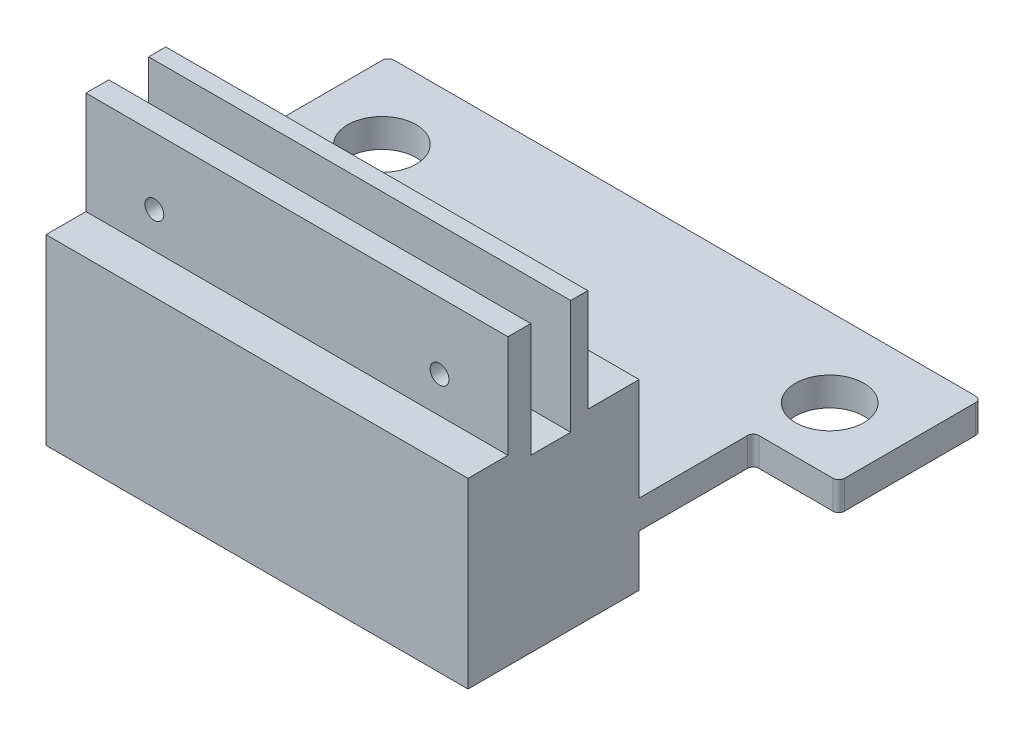
ISO-10303-21;
HEADER;
FILE_DESCRIPTION(('STEP AP214'),'2;1');
FILE_NAME('part.step','',(''),(''),'','','');
FILE_SCHEMA(('AUTOMOTIVE_DESIGN { 1 0 10303 214 1 1 1 1 }'));
ENDSEC;
DATA;
#1=APPLICATION_CONTEXT('core data for automotive mechanical design processes');
#2=APPLICATION_PROTOCOL_DEFINITION('international standard','automotive_design',2000,#1);
#3=PRODUCT_CONTEXT('',#1,'mechanical');
#4=PRODUCT('Part','Part','',(#3));
#5=PRODUCT_RELATED_PRODUCT_CATEGORY('part','',(#4));
#6=PRODUCT_DEFINITION_FORMATION('','',#4);
#7=PRODUCT_DEFINITION_CONTEXT('part definition',#1,'design');
#8=PRODUCT_DEFINITION('design','',#6,#7);
#9=PRODUCT_DEFINITION_SHAPE('','',#8);
#10=(LENGTH_UNIT() NAMED_UNIT(*) SI_UNIT(.MILLI.,.METRE.));
#11=(NAMED_UNIT(*) PLANE_ANGLE_UNIT() SI_UNIT($,.RADIAN.));
#12=(NAMED_UNIT(*) SI_UNIT($,.STERADIAN.) SOLID_ANGLE_UNIT());
#13=UNCERTAINTY_MEASURE_WITH_UNIT(LENGTH_MEASURE(1.E-05),#10,'distance_accuracy_value','');
#14=(GEOMETRIC_REPRESENTATION_CONTEXT(3) GLOBAL_UNCERTAINTY_ASSIGNED_CONTEXT((#13)) GLOBAL_UNIT_ASSIGNED_CONTEXT((#10,
#11,#12)) REPRESENTATION_CONTEXT('',''));
#15=CARTESIAN_POINT('',(0.,0.,0.));
#16=DIRECTION('',(0.,0.,1.));
#17=DIRECTION('',(1.,0.,0.));
#18=AXIS2_PLACEMENT_3D('',#15,#16,#17);
#19=CARTESIAN_POINT('',(0.,0.,30.));
#20=DIRECTION('',(1.,0.,0.));
#21=DIRECTION('',(0.,0.,-1.));
#22=AXIS2_PLACEMENT_3D('',#19,#20,#21);
#23=PLANE('',#22);
#24=DIRECTION('',(0.,0.,1.));
#25=VECTOR('',#24,1.);
#26=CARTESIAN_POINT('',(0.,14.,-45.));
#27=LINE('',#26,#25);
#28=CARTESIAN_POINT('',(0.,14.,-19.));
#29=VERTEX_POINT('',#28);
#30=CARTESIAN_POINT('',(0.,14.,0.));
#31=VERTEX_POINT('',#30);
#32=EDGE_CURVE('E220',#29,#31,#27,.T.);
#33=ORIENTED_EDGE('',*,*,#32,.F.);
#34=DIRECTION('',(0.,1.,0.));
#35=VECTOR('',#34,1.);
#36=CARTESIAN_POINT('',(0.,9.,-19.));
#37=LINE('',#36,#35);
#38=CARTESIAN_POINT('',(0.,9.,-19.));
#39=VERTEX_POINT('',#38);
#40=EDGE_CURVE('E214',#29,#39,#37,.F.);
#41=ORIENTED_EDGE('',*,*,#40,.T.);
#42=DIRECTION('',(0.,0.,1.));
#43=VECTOR('',#42,1.);
#44=CARTESIAN_POINT('',(0.,9.,-45.));
#45=LINE('',#44,#43);
#46=CARTESIAN_POINT('',(0.,9.,0.));
#47=VERTEX_POINT('',#46);
#48=EDGE_CURVE('E209',#39,#47,#45,.T.);
#49=ORIENTED_EDGE('',*,*,#48,.T.);
#50=DIRECTION('',(0.,-1.,0.));
#51=VECTOR('',#50,1.);
#52=CARTESIAN_POINT('',(0.,0.,0.));
#53=LINE('',#52,#51);
#54=CARTESIAN_POINT('',(0.,0.,0.));
#55=VERTEX_POINT('',#54);
#56=EDGE_CURVE('E212',#47,#55,#53,.T.);
#57=ORIENTED_EDGE('',*,*,#56,.T.);
#58=DIRECTION('',(0.,0.,-1.));
#59=VECTOR('',#58,1.);
#60=CARTESIAN_POINT('',(0.,0.,30.));
#61=LINE('',#60,#59);
#62=CARTESIAN_POINT('',(0.,0.,30.));
#63=VERTEX_POINT('',#62);
#64=EDGE_CURVE('E417',#63,#55,#61,.T.);
#65=ORIENTED_EDGE('',*,*,#64,.F.);
#66=DIRECTION('',(0.,-1.,0.));
#67=VECTOR('',#66,1.);
#68=CARTESIAN_POINT('',(0.,0.,30.));
#69=LINE('',#68,#67);
#70=CARTESIAN_POINT('',(0.,32.,30.));
#71=VERTEX_POINT('',#70);
#72=EDGE_CURVE('E387',#71,#63,#69,.T.);
#73=ORIENTED_EDGE('',*,*,#72,.F.);
#74=DIRECTION('',(0.,0.,-1.));
#75=VECTOR('',#74,1.);
#76=CARTESIAN_POINT('',(0.,32.,30.));
#77=LINE('',#76,#75);
#78=CARTESIAN_POINT('',(0.,32.,23.));
#79=VERTEX_POINT('',#78);
#80=EDGE_CURVE('E318',#71,#79,#77,.T.);
#81=ORIENTED_EDGE('',*,*,#80,.T.);
#82=DIRECTION('',(0.,1.,0.));
#83=VECTOR('',#82,1.);
#84=CARTESIAN_POINT('',(0.,0.,23.));
#85=LINE('',#84,#83);
#86=CARTESIAN_POINT('',(0.,50.,23.));
#87=VERTEX_POINT('',#86);
#88=EDGE_CURVE('E322',#79,#87,#85,.T.);
#89=ORIENTED_EDGE('',*,*,#88,.T.);
#90=DIRECTION('',(0.,0.,-1.));
#91=VECTOR('',#90,1.);
#92=CARTESIAN_POINT('',(0.,50.,30.));
#93=LINE('',#92,#91);
#94=CARTESIAN_POINT('',(0.,50.,19.));
#95=VERTEX_POINT('',#94);
#96=EDGE_CURVE('E406',#87,#95,#93,.T.);
#97=ORIENTED_EDGE('',*,*,#96,.T.);
#98=DIRECTION('',(0.,1.,0.));
#99=VECTOR('',#98,1.);
#100=CARTESIAN_POINT('',(0.,50.,19.));
#101=LINE('',#100,#99);
#102=CARTESIAN_POINT('',(0.,30.,19.));
#103=VERTEX_POINT('',#102);
#104=EDGE_CURVE('E338',#103,#95,#101,.T.);
#105=ORIENTED_EDGE('',*,*,#104,.F.);
#106=DIRECTION('',(0.,0.,1.));
#107=VECTOR('',#106,1.);
#108=CARTESIAN_POINT('',(0.,30.,12.));
#109=LINE('',#108,#107);
#110=CARTESIAN_POINT('',(0.,30.,12.));
#111=VERTEX_POINT('',#110);
#112=EDGE_CURVE('E334',#111,#103,#109,.T.);
#113=ORIENTED_EDGE('',*,*,#112,.F.);
#114=DIRECTION('',(0.,-1.,0.));
#115=VECTOR('',#114,1.);
#116=CARTESIAN_POINT('',(0.,50.,12.));
#117=LINE('',#116,#115);
#118=CARTESIAN_POINT('',(0.,50.,12.));
#119=VERTEX_POINT('',#118);
#120=EDGE_CURVE('E330',#119,#111,#117,.T.);
#121=ORIENTED_EDGE('',*,*,#120,.F.);
#122=CARTESIAN_POINT('',(0.,50.,9.));
#123=VERTEX_POINT('',#122);
#124=EDGE_CURVE('E397',#119,#123,#93,.T.);
#125=ORIENTED_EDGE('',*,*,#124,.T.);
#126=DIRECTION('',(0.,-1.,0.));
#127=VECTOR('',#126,1.);
#128=CARTESIAN_POINT('',(0.,0.,9.));
#129=LINE('',#128,#127);
#130=CARTESIAN_POINT('',(0.,32.,9.));
#131=VERTEX_POINT('',#130);
#132=EDGE_CURVE('E326',#123,#131,#129,.T.);
#133=ORIENTED_EDGE('',*,*,#132,.T.);
#134=DIRECTION('',(0.,0.,-1.));
#135=VECTOR('',#134,1.);
#136=CARTESIAN_POINT('',(0.,32.,30.));
#137=LINE('',#136,#135);
#138=CARTESIAN_POINT('',(0.,32.,0.));
#139=VERTEX_POINT('',#138);
#140=EDGE_CURVE('E300',#131,#139,#137,.T.);
#141=ORIENTED_EDGE('',*,*,#140,.T.);
#142=EDGE_CURVE('E231',#139,#31,#53,.T.);
#143=ORIENTED_EDGE('',*,*,#142,.T.);
#144=EDGE_LOOP('',(#33,#41,#49,#57,#65,#73,#81,#89,#97,#105,#113,#121,#125,#133,#141,#143));
#145=FACE_BOUND('',#144,.T.);
#146=ADVANCED_FACE('F38',(#145),#23,.F.);
#147=CARTESIAN_POINT('',(74.,0.,30.));
#148=DIRECTION('',(-1.,0.,0.));
#149=DIRECTION('',(0.,0.,1.));
#150=AXIS2_PLACEMENT_3D('',#147,#148,#149);
#151=PLANE('',#150);
#152=DIRECTION('',(0.,0.,1.));
#153=VECTOR('',#152,1.);
#154=CARTESIAN_POINT('',(74.,9.,-45.));
#155=LINE('',#154,#153);
#156=CARTESIAN_POINT('',(74.,9.,-19.));
#157=VERTEX_POINT('',#156);
#158=CARTESIAN_POINT('',(74.,9.,0.));
#159=VERTEX_POINT('',#158);
#160=EDGE_CURVE('E219',#157,#159,#155,.T.);
#161=ORIENTED_EDGE('',*,*,#160,.F.);
#162=DIRECTION('',(0.,-1.,0.));
#163=VECTOR('',#162,1.);
#164=CARTESIAN_POINT('',(74.,14.,-19.));
#165=LINE('',#164,#163);
#166=CARTESIAN_POINT('',(74.,14.,-19.));
#167=VERTEX_POINT('',#166);
#168=EDGE_CURVE('E462',#157,#167,#165,.F.);
#169=ORIENTED_EDGE('',*,*,#168,.T.);
#170=DIRECTION('',(0.,0.,1.));
#171=VECTOR('',#170,1.);
#172=CARTESIAN_POINT('',(74.,14.,-45.));
#173=LINE('',#172,#171);
#174=CARTESIAN_POINT('',(74.,14.,0.));
#175=VERTEX_POINT('',#174);
#176=EDGE_CURVE('E253',#167,#175,#173,.T.);
#177=ORIENTED_EDGE('',*,*,#176,.T.);
#178=DIRECTION('',(0.,1.,0.));
#179=VECTOR('',#178,1.);
#180=CARTESIAN_POINT('',(74.,0.,0.));
#181=LINE('',#180,#179);
#182=CARTESIAN_POINT('',(74.,32.,0.));
#183=VERTEX_POINT('',#182);
#184=EDGE_CURVE('E403',#175,#183,#181,.T.);
#185=ORIENTED_EDGE('',*,*,#184,.T.);
#186=DIRECTION('',(0.,0.,-1.));
#187=VECTOR('',#186,1.);
#188=CARTESIAN_POINT('',(74.,32.,0.));
#189=LINE('',#188,#187);
#190=CARTESIAN_POINT('',(74.,32.,9.));
#191=VERTEX_POINT('',#190);
#192=EDGE_CURVE('E306',#191,#183,#189,.T.);
#193=ORIENTED_EDGE('',*,*,#192,.F.);
#194=DIRECTION('',(0.,-1.,0.));
#195=VECTOR('',#194,1.);
#196=CARTESIAN_POINT('',(74.,50.,9.));
#197=LINE('',#196,#195);
#198=CARTESIAN_POINT('',(74.,50.,9.));
#199=VERTEX_POINT('',#198);
#200=EDGE_CURVE('E286',#199,#191,#197,.T.);
#201=ORIENTED_EDGE('',*,*,#200,.F.);
#202=DIRECTION('',(0.,0.,-1.));
#203=VECTOR('',#202,1.);
#204=CARTESIAN_POINT('',(74.,50.,30.));
#205=LINE('',#204,#203);
#206=CARTESIAN_POINT('',(74.,50.,12.));
#207=VERTEX_POINT('',#206);
#208=EDGE_CURVE('E409',#207,#199,#205,.T.);
#209=ORIENTED_EDGE('',*,*,#208,.F.);
#210=DIRECTION('',(0.,-1.,0.));
#211=VECTOR('',#210,1.);
#212=CARTESIAN_POINT('',(74.,0.,12.));
#213=LINE('',#212,#211);
#214=CARTESIAN_POINT('',(74.,30.,12.));
#215=VERTEX_POINT('',#214);
#216=EDGE_CURVE('E352',#207,#215,#213,.T.);
#217=ORIENTED_EDGE('',*,*,#216,.T.);
#218=DIRECTION('',(0.,0.,1.));
#219=VECTOR('',#218,1.);
#220=CARTESIAN_POINT('',(74.,30.,30.));
#221=LINE('',#220,#219);
#222=CARTESIAN_POINT('',(74.,30.,19.));
#223=VERTEX_POINT('',#222);
#224=EDGE_CURVE('E428',#215,#223,#221,.T.);
#225=ORIENTED_EDGE('',*,*,#224,.T.);
#226=DIRECTION('',(0.,1.,0.));
#227=VECTOR('',#226,1.);
#228=CARTESIAN_POINT('',(74.,0.,19.));
#229=LINE('',#228,#227);
#230=CARTESIAN_POINT('',(74.,50.,19.));
#231=VERTEX_POINT('',#230);
#232=EDGE_CURVE('E346',#223,#231,#229,.T.);
#233=ORIENTED_EDGE('',*,*,#232,.T.);
#234=CARTESIAN_POINT('',(74.,50.,23.));
#235=VERTEX_POINT('',#234);
#236=EDGE_CURVE('E410',#235,#231,#205,.T.);
#237=ORIENTED_EDGE('',*,*,#236,.F.);
#238=DIRECTION('',(0.,1.,0.));
#239=VECTOR('',#238,1.);
#240=CARTESIAN_POINT('',(74.,50.,23.));
#241=LINE('',#240,#239);
#242=CARTESIAN_POINT('',(74.,32.,23.));
#243=VERTEX_POINT('',#242);
#244=EDGE_CURVE('E291',#243,#235,#241,.T.);
#245=ORIENTED_EDGE('',*,*,#244,.F.);
#246=DIRECTION('',(0.,0.,-1.));
#247=VECTOR('',#246,1.);
#248=CARTESIAN_POINT('',(74.,32.,30.));
#249=LINE('',#248,#247);
#250=CARTESIAN_POINT('',(74.,32.,30.));
#251=VERTEX_POINT('',#250);
#252=EDGE_CURVE('E287',#251,#243,#249,.T.);
#253=ORIENTED_EDGE('',*,*,#252,.F.);
#254=DIRECTION('',(0.,1.,0.));
#255=VECTOR('',#254,1.);
#256=CARTESIAN_POINT('',(74.,0.,30.));
#257=LINE('',#256,#255);
#258=CARTESIAN_POINT('',(74.,0.,30.));
#259=VERTEX_POINT('',#258);
#260=EDGE_CURVE('E394',#259,#251,#257,.T.);
#261=ORIENTED_EDGE('',*,*,#260,.F.);
#262=DIRECTION('',(0.,0.,-1.));
#263=VECTOR('',#262,1.);
#264=CARTESIAN_POINT('',(74.,0.,30.));
#265=LINE('',#264,#263);
#266=CARTESIAN_POINT('',(74.,0.,0.));
#267=VERTEX_POINT('',#266);
#268=EDGE_CURVE('E413',#259,#267,#265,.T.);
#269=ORIENTED_EDGE('',*,*,#268,.T.);
#270=EDGE_CURVE('E391',#267,#159,#181,.T.);
#271=ORIENTED_EDGE('',*,*,#270,.T.);
#272=EDGE_LOOP('',(#161,#169,#177,#185,#193,#201,#209,#217,#225,#233,#237,#245,#253,#261,#269,#271));
#273=FACE_BOUND('',#272,.T.);
#274=ADVANCED_FACE('F590',(#273),#151,.F.);
#275=CARTESIAN_POINT('',(0.,0.,0.));
#276=DIRECTION('',(0.,0.,-1.));
#277=DIRECTION('',(-1.,0.,0.));
#278=AXIS2_PLACEMENT_3D('',#275,#276,#277);
#279=PLANE('',#278);
#280=DIRECTION('',(1.,0.,0.));
#281=VECTOR('',#280,1.);
#282=CARTESIAN_POINT('',(74.,14.,0.));
#283=LINE('',#282,#281);
#284=EDGE_CURVE('E238',#31,#175,#283,.T.);
#285=ORIENTED_EDGE('',*,*,#284,.F.);
#286=ORIENTED_EDGE('',*,*,#142,.F.);
#287=DIRECTION('',(-1.,0.,0.));
#288=VECTOR('',#287,1.);
#289=CARTESIAN_POINT('',(0.,32.,0.));
#290=LINE('',#289,#288);
#291=EDGE_CURVE('E432',#183,#139,#290,.T.);
#292=ORIENTED_EDGE('',*,*,#291,.F.);
#293=ORIENTED_EDGE('',*,*,#184,.F.);
#294=EDGE_LOOP('',(#285,#286,#292,#293));
#295=FACE_BOUND('',#294,.T.);
#296=ADVANCED_FACE('F595',(#295),#279,.T.);
#297=CARTESIAN_POINT('',(0.,50.,30.));
#298=DIRECTION('',(0.,-1.,0.));
#299=DIRECTION('',(0.,0.,-1.));
#300=AXIS2_PLACEMENT_3D('',#297,#298,#299);
#301=PLANE('',#300);
#302=ORIENTED_EDGE('',*,*,#208,.T.);
#303=DIRECTION('',(1.,0.,0.));
#304=VECTOR('',#303,1.);
#305=CARTESIAN_POINT('',(-37.0000000000001,50.,9.));
#306=LINE('',#305,#304);
#307=EDGE_CURVE('E310',#123,#199,#306,.T.);
#308=ORIENTED_EDGE('',*,*,#307,.F.);
#309=ORIENTED_EDGE('',*,*,#124,.F.);
#310=DIRECTION('',(1.,0.,0.));
#311=VECTOR('',#310,1.);
#312=CARTESIAN_POINT('',(0.,50.,12.));
#313=LINE('',#312,#311);
#314=EDGE_CURVE('E424',#119,#207,#313,.T.);
#315=ORIENTED_EDGE('',*,*,#314,.T.);
#316=EDGE_LOOP('',(#302,#308,#309,#315));
#317=FACE_BOUND('',#316,.T.);
#318=ADVANCED_FACE('F682',(#317),#301,.F.);
#319=CARTESIAN_POINT('',(0.,0.,30.));
#320=DIRECTION('',(0.,1.,0.));
#321=DIRECTION('',(0.,0.,1.));
#322=AXIS2_PLACEMENT_3D('',#319,#320,#321);
#323=PLANE('',#322);
#324=CARTESIAN_POINT('',(12.74,0.,15.));
#325=DIRECTION('',(0.,-1.,0.));
#326=DIRECTION('',(0.,0.,-1.));
#327=AXIS2_PLACEMENT_3D('',#324,#325,#326);
#328=CIRCLE('',#327,10.5);
#329=CARTESIAN_POINT('',(12.74,0.,4.5));
#330=VERTEX_POINT('',#329);
#331=EDGE_CURVE('E376',#330,#330,#328,.T.);
#332=ORIENTED_EDGE('',*,*,#331,.F.);
#333=EDGE_LOOP('',(#332));
#334=FACE_BOUND('',#333,.T.);
#335=CARTESIAN_POINT('',(61.26167258,0.,15.0000000000002));
#336=DIRECTION('',(0.,-1.,0.));
#337=DIRECTION('',(0.,0.,-1.));
#338=AXIS2_PLACEMENT_3D('',#335,#336,#337);
#339=CIRCLE('',#338,10.5);
#340=CARTESIAN_POINT('',(61.26167258,0.,4.50000000000016));
#341=VERTEX_POINT('',#340);
#342=EDGE_CURVE('E361',#341,#341,#339,.T.);
#343=ORIENTED_EDGE('',*,*,#342,.F.);
#344=EDGE_LOOP('',(#343));
#345=FACE_BOUND('',#344,.T.);
#346=DIRECTION('',(1.,0.,0.));
#347=VECTOR('',#346,1.);
#348=CARTESIAN_POINT('',(0.,0.,0.));
#349=LINE('',#348,#347);
#350=EDGE_CURVE('E228',#55,#267,#349,.T.);
#351=ORIENTED_EDGE('',*,*,#350,.T.);
#352=ORIENTED_EDGE('',*,*,#268,.F.);
#353=DIRECTION('',(1.,0.,0.));
#354=VECTOR('',#353,1.);
#355=CARTESIAN_POINT('',(0.,0.,30.));
#356=LINE('',#355,#354);
#357=EDGE_CURVE('E390',#63,#259,#356,.T.);
#358=ORIENTED_EDGE('',*,*,#357,.F.);
#359=ORIENTED_EDGE('',*,*,#64,.T.);
#360=EDGE_LOOP('',(#351,#352,#358,#359));
#361=FACE_BOUND('',#360,.T.);
#362=ADVANCED_FACE('F600',(#334,#345,#361),#323,.F.);
#363=ORIENTED_EDGE('',*,*,#96,.F.);
#364=DIRECTION('',(1.,0.,0.));
#365=VECTOR('',#364,1.);
#366=CARTESIAN_POINT('',(-37.0000000000001,50.,23.));
#367=LINE('',#366,#365);
#368=EDGE_CURVE('E296',#87,#235,#367,.T.);
#369=ORIENTED_EDGE('',*,*,#368,.T.);
#370=ORIENTED_EDGE('',*,*,#236,.T.);
#371=DIRECTION('',(-1.,0.,0.));
#372=VECTOR('',#371,1.);
#373=CARTESIAN_POINT('',(0.,50.,19.));
#374=LINE('',#373,#372);
#375=EDGE_CURVE('E420',#231,#95,#374,.T.);
#376=ORIENTED_EDGE('',*,*,#375,.T.);
#377=EDGE_LOOP('',(#363,#369,#370,#376));
#378=FACE_BOUND('',#377,.T.);
#379=ADVANCED_FACE('F667',(#378),#301,.F.);
#380=CARTESIAN_POINT('',(0.,0.,30.));
#381=DIRECTION('',(0.,0.,-1.));
#382=DIRECTION('',(-1.,0.,0.));
#383=AXIS2_PLACEMENT_3D('',#380,#381,#382);
#384=PLANE('',#383);
#385=ORIENTED_EDGE('',*,*,#260,.T.);
#386=DIRECTION('',(-1.,0.,0.));
#387=VECTOR('',#386,1.);
#388=CARTESIAN_POINT('',(0.,32.,30.));
#389=LINE('',#388,#387);
#390=EDGE_CURVE('E435',#251,#71,#389,.T.);
#391=ORIENTED_EDGE('',*,*,#390,.T.);
#392=ORIENTED_EDGE('',*,*,#72,.T.);
#393=ORIENTED_EDGE('',*,*,#357,.T.);
#394=EDGE_LOOP('',(#385,#391,#392,#393));
#395=FACE_BOUND('',#394,.T.);
#396=ADVANCED_FACE('F657',(#395),#384,.F.);
#397=DIRECTION('',(-1.,0.,0.));
#398=VECTOR('',#397,1.);
#399=CARTESIAN_POINT('',(74.,9.,0.));
#400=LINE('',#399,#398);
#401=EDGE_CURVE('E226',#159,#47,#400,.T.);
#402=ORIENTED_EDGE('',*,*,#401,.F.);
#403=ORIENTED_EDGE('',*,*,#270,.F.);
#404=ORIENTED_EDGE('',*,*,#350,.F.);
#405=ORIENTED_EDGE('',*,*,#56,.F.);
#406=EDGE_LOOP('',(#402,#403,#404,#405));
#407=FACE_BOUND('',#406,.T.);
#408=ADVANCED_FACE('F224',(#407),#279,.T.);
#409=CARTESIAN_POINT('',(61.26167258,10.,15.0000000000002));
#410=DIRECTION('',(0.,-1.,0.));
#411=DIRECTION('',(0.,0.,-1.));
#412=AXIS2_PLACEMENT_3D('',#409,#410,#411);
#413=CYLINDRICAL_SURFACE('',#412,10.5);
#414=CARTESIAN_POINT('',(61.26167258,10.,15.0000000000002));
#415=DIRECTION('',(0.,-1.,0.));
#416=DIRECTION('',(0.,0.,-1.));
#417=AXIS2_PLACEMENT_3D('',#414,#415,#416);
#418=CIRCLE('',#417,10.5);
#419=CARTESIAN_POINT('',(61.26167258,10.,4.50000000000016));
#420=VERTEX_POINT('',#419);
#421=EDGE_CURVE('E380',#420,#420,#418,.T.);
#422=ORIENTED_EDGE('',*,*,#421,.F.);
#423=EDGE_LOOP('',(#422));
#424=FACE_BOUND('',#423,.T.);
#425=ORIENTED_EDGE('',*,*,#342,.T.);
#426=EDGE_LOOP('',(#425));
#427=FACE_BOUND('',#426,.T.);
#428=ADVANCED_FACE('F704',(#424,#427),#413,.F.);
#429=CARTESIAN_POINT('',(61.26167258,10.,15.0000000000002));
#430=DIRECTION('',(0.,-1.,0.));
#431=DIRECTION('',(0.,0.,-1.));
#432=AXIS2_PLACEMENT_3D('',#429,#430,#431);
#433=PLANE('',#432);
#434=CARTESIAN_POINT('',(61.26167258,10.,15.0000000000002));
#435=DIRECTION('',(0.,-1.,0.));
#436=DIRECTION('',(0.,0.,-1.));
#437=AXIS2_PLACEMENT_3D('',#434,#435,#436);
#438=CIRCLE('',#437,6.24999999999999);
#439=CARTESIAN_POINT('',(61.26167258,10.,8.75000000000016));
#440=VERTEX_POINT('',#439);
#441=EDGE_CURVE('E356',#440,#440,#438,.T.);
#442=ORIENTED_EDGE('',*,*,#441,.F.);
#443=EDGE_LOOP('',(#442));
#444=FACE_BOUND('',#443,.T.);
#445=ORIENTED_EDGE('',*,*,#421,.T.);
#446=EDGE_LOOP('',(#445));
#447=FACE_BOUND('',#446,.T.);
#448=ADVANCED_FACE('F709',(#444,#447),#433,.T.);
#449=CARTESIAN_POINT('',(12.74,10.,15.));
#450=DIRECTION('',(0.,-1.,0.));
#451=DIRECTION('',(0.,0.,-1.));
#452=AXIS2_PLACEMENT_3D('',#449,#450,#451);
#453=CYLINDRICAL_SURFACE('',#452,10.5);
#454=CARTESIAN_POINT('',(12.74,10.,15.));
#455=DIRECTION('',(0.,-1.,0.));
#456=DIRECTION('',(0.,0.,-1.));
#457=AXIS2_PLACEMENT_3D('',#454,#455,#456);
#458=CIRCLE('',#457,10.5);
#459=CARTESIAN_POINT('',(12.74,10.,4.5));
#460=VERTEX_POINT('',#459);
#461=EDGE_CURVE('E232',#460,#460,#458,.T.);
#462=ORIENTED_EDGE('',*,*,#461,.F.);
#463=EDGE_LOOP('',(#462));
#464=FACE_BOUND('',#463,.T.);
#465=ORIENTED_EDGE('',*,*,#331,.T.);
#466=EDGE_LOOP('',(#465));
#467=FACE_BOUND('',#466,.T.);
#468=ADVANCED_FACE('F718',(#464,#467),#453,.F.);
#469=CARTESIAN_POINT('',(12.74,10.,15.));
#470=DIRECTION('',(0.,-1.,0.));
#471=DIRECTION('',(0.,0.,-1.));
#472=AXIS2_PLACEMENT_3D('',#469,#470,#471);
#473=PLANE('',#472);
#474=CARTESIAN_POINT('',(12.74,10.,15.));
#475=DIRECTION('',(0.,-1.,0.));
#476=DIRECTION('',(0.,0.,-1.));
#477=AXIS2_PLACEMENT_3D('',#474,#475,#476);
#478=CIRCLE('',#477,6.25);
#479=CARTESIAN_POINT('',(12.74,10.,8.75));
#480=VERTEX_POINT('',#479);
#481=EDGE_CURVE('E362',#480,#480,#478,.T.);
#482=ORIENTED_EDGE('',*,*,#481,.F.);
#483=EDGE_LOOP('',(#482));
#484=FACE_BOUND('',#483,.T.);
#485=ORIENTED_EDGE('',*,*,#461,.T.);
#486=EDGE_LOOP('',(#485));
#487=FACE_BOUND('',#486,.T.);
#488=ADVANCED_FACE('F722',(#484,#487),#473,.T.);
#489=CARTESIAN_POINT('',(12.74,20.,15.));
#490=DIRECTION('',(0.,-1.,0.));
#491=DIRECTION('',(0.,0.,-1.));
#492=AXIS2_PLACEMENT_3D('',#489,#490,#491);
#493=CYLINDRICAL_SURFACE('',#492,6.25);
#494=CARTESIAN_POINT('',(12.74,20.,15.));
#495=DIRECTION('',(0.,-1.,0.));
#496=DIRECTION('',(0.,0.,-1.));
#497=AXIS2_PLACEMENT_3D('',#494,#495,#496);
#498=CIRCLE('',#497,6.25);
#499=CARTESIAN_POINT('',(12.74,20.,8.75));
#500=VERTEX_POINT('',#499);
#501=EDGE_CURVE('E357',#500,#500,#498,.T.);
#502=ORIENTED_EDGE('',*,*,#501,.F.);
#503=EDGE_LOOP('',(#502));
#504=FACE_BOUND('',#503,.T.);
#505=ORIENTED_EDGE('',*,*,#481,.T.);
#506=EDGE_LOOP('',(#505));
#507=FACE_BOUND('',#506,.T.);
#508=ADVANCED_FACE('F726',(#504,#507),#493,.F.);
#509=CARTESIAN_POINT('',(12.74,20.,15.));
#510=DIRECTION('',(0.,-1.,0.));
#511=DIRECTION('',(0.,0.,-1.));
#512=AXIS2_PLACEMENT_3D('',#509,#510,#511);
#513=PLANE('',#512);
#514=ORIENTED_EDGE('',*,*,#501,.T.);
#515=EDGE_LOOP('',(#514));
#516=FACE_BOUND('',#515,.T.);
#517=ADVANCED_FACE('F732',(#516),#513,.T.);
#518=CARTESIAN_POINT('',(61.26167258,20.,15.0000000000002));
#519=DIRECTION('',(0.,-1.,0.));
#520=DIRECTION('',(0.,0.,-1.));
#521=AXIS2_PLACEMENT_3D('',#518,#519,#520);
#522=CYLINDRICAL_SURFACE('',#521,6.24999999999999);
#523=CARTESIAN_POINT('',(61.26167258,20.,15.0000000000002));
#524=DIRECTION('',(0.,-1.,0.));
#525=DIRECTION('',(0.,0.,-1.));
#526=AXIS2_PLACEMENT_3D('',#523,#524,#525);
#527=CIRCLE('',#526,6.24999999999999);
#528=CARTESIAN_POINT('',(61.26167258,20.,8.75000000000016));
#529=VERTEX_POINT('',#528);
#530=EDGE_CURVE('E366',#529,#529,#527,.T.);
#531=ORIENTED_EDGE('',*,*,#530,.F.);
#532=EDGE_LOOP('',(#531));
#533=FACE_BOUND('',#532,.T.);
#534=ORIENTED_EDGE('',*,*,#441,.T.);
#535=EDGE_LOOP('',(#534));
#536=FACE_BOUND('',#535,.T.);
#537=ADVANCED_FACE('F728',(#533,#536),#522,.F.);
#538=CARTESIAN_POINT('',(61.26167258,20.,15.0000000000002));
#539=DIRECTION('',(0.,-1.,0.));
#540=DIRECTION('',(0.,0.,-1.));
#541=AXIS2_PLACEMENT_3D('',#538,#539,#540);
#542=PLANE('',#541);
#543=ORIENTED_EDGE('',*,*,#530,.T.);
#544=EDGE_LOOP('',(#543));
#545=FACE_BOUND('',#544,.T.);
#546=ADVANCED_FACE('F731',(#545),#542,.T.);
#547=CARTESIAN_POINT('',(111.,30.,12.));
#548=DIRECTION('',(0.,-1.,0.));
#549=DIRECTION('',(0.,0.,-1.));
#550=AXIS2_PLACEMENT_3D('',#547,#548,#549);
#551=PLANE('',#550);
#552=DIRECTION('',(-1.,0.,0.));
#553=VECTOR('',#552,1.);
#554=CARTESIAN_POINT('',(111.,30.,12.));
#555=LINE('',#554,#553);
#556=EDGE_CURVE('E342',#215,#111,#555,.T.);
#557=ORIENTED_EDGE('',*,*,#556,.T.);
#558=ORIENTED_EDGE('',*,*,#112,.T.);
#559=DIRECTION('',(-1.,0.,0.));
#560=VECTOR('',#559,1.);
#561=CARTESIAN_POINT('',(111.,30.,19.));
#562=LINE('',#561,#560);
#563=EDGE_CURVE('E343',#223,#103,#562,.T.);
#564=ORIENTED_EDGE('',*,*,#563,.F.);
#565=ORIENTED_EDGE('',*,*,#224,.F.);
#566=EDGE_LOOP('',(#557,#558,#564,#565));
#567=FACE_BOUND('',#566,.T.);
#568=ADVANCED_FACE('F675',(#567),#551,.F.);
#569=CARTESIAN_POINT('',(111.,50.,12.));
#570=DIRECTION('',(0.,0.,-1.));
#571=DIRECTION('',(0.,1.,0.));
#572=AXIS2_PLACEMENT_3D('',#569,#570,#571);
#573=PLANE('',#572);
#574=CARTESIAN_POINT('',(62.,38.3089270308315,12.));
#575=DIRECTION('',(0.,0.,-1.));
#576=DIRECTION('',(0.,1.,0.));
#577=AXIS2_PLACEMENT_3D('',#574,#575,#576);
#578=CIRCLE('',#577,1.65);
#579=CARTESIAN_POINT('',(62.,39.9589270308315,12.));
#580=VERTEX_POINT('',#579);
#581=EDGE_CURVE('E282',#580,#580,#578,.T.);
#582=ORIENTED_EDGE('',*,*,#581,.T.);
#583=EDGE_LOOP('',(#582));
#584=FACE_BOUND('',#583,.T.);
#585=CARTESIAN_POINT('',(12.,38.3089270308315,12.));
#586=DIRECTION('',(0.,0.,-1.));
#587=DIRECTION('',(0.,1.,0.));
#588=AXIS2_PLACEMENT_3D('',#585,#586,#587);
#589=CIRCLE('',#588,1.65);
#590=CARTESIAN_POINT('',(12.,39.9589270308315,12.));
#591=VERTEX_POINT('',#590);
#592=EDGE_CURVE('E273',#591,#591,#589,.T.);
#593=ORIENTED_EDGE('',*,*,#592,.T.);
#594=EDGE_LOOP('',(#593));
#595=FACE_BOUND('',#594,.T.);
#596=ORIENTED_EDGE('',*,*,#314,.F.);
#597=ORIENTED_EDGE('',*,*,#120,.T.);
#598=ORIENTED_EDGE('',*,*,#556,.F.);
#599=ORIENTED_EDGE('',*,*,#216,.F.);
#600=EDGE_LOOP('',(#596,#597,#598,#599));
#601=FACE_BOUND('',#600,.T.);
#602=ADVANCED_FACE('F743',(#584,#595,#601),#573,.F.);
#603=CARTESIAN_POINT('',(111.,50.,19.));
#604=DIRECTION('',(0.,0.,1.));
#605=DIRECTION('',(0.,-1.,0.));
#606=AXIS2_PLACEMENT_3D('',#603,#604,#605);
#607=PLANE('',#606);
#608=CARTESIAN_POINT('',(62.,38.3089270308315,19.));
#609=DIRECTION('',(0.,0.,1.));
#610=DIRECTION('',(0.,-1.,0.));
#611=AXIS2_PLACEMENT_3D('',#608,#609,#610);
#612=CIRCLE('',#611,1.65);
#613=CARTESIAN_POINT('',(62.,36.6589270308315,19.));
#614=VERTEX_POINT('',#613);
#615=EDGE_CURVE('E278',#614,#614,#612,.T.);
#616=ORIENTED_EDGE('',*,*,#615,.T.);
#617=EDGE_LOOP('',(#616));
#618=FACE_BOUND('',#617,.T.);
#619=CARTESIAN_POINT('',(12.,38.3089270308315,19.));
#620=DIRECTION('',(0.,0.,1.));
#621=DIRECTION('',(0.,-1.,0.));
#622=AXIS2_PLACEMENT_3D('',#619,#620,#621);
#623=CIRCLE('',#622,1.65);
#624=CARTESIAN_POINT('',(12.,36.6589270308315,19.));
#625=VERTEX_POINT('',#624);
#626=EDGE_CURVE('E269',#625,#625,#623,.T.);
#627=ORIENTED_EDGE('',*,*,#626,.T.);
#628=EDGE_LOOP('',(#627));
#629=FACE_BOUND('',#628,.T.);
#630=ORIENTED_EDGE('',*,*,#563,.T.);
#631=ORIENTED_EDGE('',*,*,#104,.T.);
#632=ORIENTED_EDGE('',*,*,#375,.F.);
#633=ORIENTED_EDGE('',*,*,#232,.F.);
#634=EDGE_LOOP('',(#630,#631,#632,#633));
#635=FACE_BOUND('',#634,.T.);
#636=ADVANCED_FACE('F672',(#618,#629,#635),#607,.F.);
#637=CARTESIAN_POINT('',(-37.0000000000001,50.,9.));
#638=DIRECTION('',(0.,0.,1.));
#639=DIRECTION('',(0.,-1.,0.));
#640=AXIS2_PLACEMENT_3D('',#637,#638,#639);
#641=PLANE('',#640);
#642=CARTESIAN_POINT('',(62.,38.3089270308315,9.));
#643=DIRECTION('',(0.,0.,-1.));
#644=DIRECTION('',(0.,1.,0.));
#645=AXIS2_PLACEMENT_3D('',#642,#643,#644);
#646=CIRCLE('',#645,1.65);
#647=CARTESIAN_POINT('',(62.,39.9589270308315,9.));
#648=VERTEX_POINT('',#647);
#649=EDGE_CURVE('E261',#648,#648,#646,.T.);
#650=ORIENTED_EDGE('',*,*,#649,.F.);
#651=EDGE_LOOP('',(#650));
#652=FACE_BOUND('',#651,.T.);
#653=CARTESIAN_POINT('',(12.,38.3089270308315,9.));
#654=DIRECTION('',(0.,0.,-1.));
#655=DIRECTION('',(0.,1.,0.));
#656=AXIS2_PLACEMENT_3D('',#653,#654,#655);
#657=CIRCLE('',#656,1.65);
#658=CARTESIAN_POINT('',(12.,39.9589270308315,9.));
#659=VERTEX_POINT('',#658);
#660=EDGE_CURVE('E260',#659,#659,#657,.T.);
#661=ORIENTED_EDGE('',*,*,#660,.F.);
#662=EDGE_LOOP('',(#661));
#663=FACE_BOUND('',#662,.T.);
#664=ORIENTED_EDGE('',*,*,#307,.T.);
#665=ORIENTED_EDGE('',*,*,#200,.T.);
#666=DIRECTION('',(1.,0.,0.));
#667=VECTOR('',#666,1.);
#668=CARTESIAN_POINT('',(-37.0000000000001,32.,9.));
#669=LINE('',#668,#667);
#670=EDGE_CURVE('E292',#131,#191,#669,.T.);
#671=ORIENTED_EDGE('',*,*,#670,.F.);
#672=ORIENTED_EDGE('',*,*,#132,.F.);
#673=EDGE_LOOP('',(#664,#665,#671,#672));
#674=FACE_BOUND('',#673,.T.);
#675=ADVANCED_FACE('F686',(#652,#663,#674),#641,.F.);
#676=CARTESIAN_POINT('',(-37.0000000000001,32.,0.));
#677=DIRECTION('',(0.,-1.,0.));
#678=DIRECTION('',(0.,0.,-1.));
#679=AXIS2_PLACEMENT_3D('',#676,#677,#678);
#680=PLANE('',#679);
#681=ORIENTED_EDGE('',*,*,#670,.T.);
#682=ORIENTED_EDGE('',*,*,#192,.T.);
#683=ORIENTED_EDGE('',*,*,#291,.T.);
#684=ORIENTED_EDGE('',*,*,#140,.F.);
#685=EDGE_LOOP('',(#681,#682,#683,#684));
#686=FACE_BOUND('',#685,.T.);
#687=ADVANCED_FACE('F692',(#686),#680,.F.);
#688=CARTESIAN_POINT('',(-37.0000000000001,50.,23.));
#689=DIRECTION('',(0.,0.,-1.));
#690=DIRECTION('',(0.,1.,0.));
#691=AXIS2_PLACEMENT_3D('',#688,#689,#690);
#692=PLANE('',#691);
#693=CARTESIAN_POINT('',(62.,38.3089270308315,23.));
#694=DIRECTION('',(0.,0.,-1.));
#695=DIRECTION('',(0.,1.,0.));
#696=AXIS2_PLACEMENT_3D('',#693,#694,#695);
#697=CIRCLE('',#696,1.65);
#698=CARTESIAN_POINT('',(62.,39.9589270308315,23.));
#699=VERTEX_POINT('',#698);
#700=EDGE_CURVE('E277',#699,#699,#697,.T.);
#701=ORIENTED_EDGE('',*,*,#700,.T.);
#702=EDGE_LOOP('',(#701));
#703=FACE_BOUND('',#702,.T.);
#704=CARTESIAN_POINT('',(12.,38.3089270308315,23.));
#705=DIRECTION('',(0.,0.,-1.));
#706=DIRECTION('',(0.,1.,0.));
#707=AXIS2_PLACEMENT_3D('',#704,#705,#706);
#708=CIRCLE('',#707,1.65);
#709=CARTESIAN_POINT('',(12.,39.9589270308315,23.));
#710=VERTEX_POINT('',#709);
#711=EDGE_CURVE('E265',#710,#710,#708,.T.);
#712=ORIENTED_EDGE('',*,*,#711,.T.);
#713=EDGE_LOOP('',(#712));
#714=FACE_BOUND('',#713,.T.);
#715=DIRECTION('',(1.,0.,0.));
#716=VECTOR('',#715,1.);
#717=CARTESIAN_POINT('',(-37.0000000000001,32.,23.));
#718=LINE('',#717,#716);
#719=EDGE_CURVE('E295',#79,#243,#718,.T.);
#720=ORIENTED_EDGE('',*,*,#719,.T.);
#721=ORIENTED_EDGE('',*,*,#244,.T.);
#722=ORIENTED_EDGE('',*,*,#368,.F.);
#723=ORIENTED_EDGE('',*,*,#88,.F.);
#724=EDGE_LOOP('',(#720,#721,#722,#723));
#725=FACE_BOUND('',#724,.T.);
#726=ADVANCED_FACE('F664',(#703,#714,#725),#692,.F.);
#727=CARTESIAN_POINT('',(-37.0000000000001,32.,30.));
#728=DIRECTION('',(0.,-1.,0.));
#729=DIRECTION('',(0.,0.,-1.));
#730=AXIS2_PLACEMENT_3D('',#727,#728,#729);
#731=PLANE('',#730);
#732=ORIENTED_EDGE('',*,*,#390,.F.);
#733=ORIENTED_EDGE('',*,*,#252,.T.);
#734=ORIENTED_EDGE('',*,*,#719,.F.);
#735=ORIENTED_EDGE('',*,*,#80,.F.);
#736=EDGE_LOOP('',(#732,#733,#734,#735));
#737=FACE_BOUND('',#736,.T.);
#738=ADVANCED_FACE('F659',(#737),#731,.F.);
#739=CARTESIAN_POINT('',(12.,38.3089270308314,120.));
#740=DIRECTION('',(0.,0.,-1.));
#741=DIRECTION('',(0.,1.,0.));
#742=AXIS2_PLACEMENT_3D('',#739,#740,#741);
#743=CYLINDRICAL_SURFACE('',#742,1.65);
#744=ORIENTED_EDGE('',*,*,#711,.F.);
#745=EDGE_LOOP('',(#744));
#746=FACE_BOUND('',#745,.T.);
#747=ORIENTED_EDGE('',*,*,#626,.F.);
#748=EDGE_LOOP('',(#747));
#749=FACE_BOUND('',#748,.T.);
#750=ADVANCED_FACE('F759',(#746,#749),#743,.F.);
#751=CARTESIAN_POINT('',(62.,38.3089270308314,120.));
#752=DIRECTION('',(0.,0.,-1.));
#753=DIRECTION('',(0.,1.,0.));
#754=AXIS2_PLACEMENT_3D('',#751,#752,#753);
#755=CYLINDRICAL_SURFACE('',#754,1.65);
#756=ORIENTED_EDGE('',*,*,#700,.F.);
#757=EDGE_LOOP('',(#756));
#758=FACE_BOUND('',#757,.T.);
#759=ORIENTED_EDGE('',*,*,#615,.F.);
#760=EDGE_LOOP('',(#759));
#761=FACE_BOUND('',#760,.T.);
#762=ADVANCED_FACE('F767',(#758,#761),#755,.F.);
#763=ORIENTED_EDGE('',*,*,#660,.T.);
#764=EDGE_LOOP('',(#763));
#765=FACE_BOUND('',#764,.T.);
#766=ORIENTED_EDGE('',*,*,#592,.F.);
#767=EDGE_LOOP('',(#766));
#768=FACE_BOUND('',#767,.T.);
#769=ADVANCED_FACE('F763',(#765,#768),#743,.F.);
#770=ORIENTED_EDGE('',*,*,#649,.T.);
#771=EDGE_LOOP('',(#770));
#772=FACE_BOUND('',#771,.T.);
#773=ORIENTED_EDGE('',*,*,#581,.F.);
#774=EDGE_LOOP('',(#773));
#775=FACE_BOUND('',#774,.T.);
#776=ADVANCED_FACE('F766',(#772,#775),#755,.F.);
#777=CARTESIAN_POINT('',(74.,9.,-45.));
#778=DIRECTION('',(0.,1.,0.));
#779=DIRECTION('',(0.,0.,1.));
#780=AXIS2_PLACEMENT_3D('',#777,#778,#779);
#781=PLANE('',#780);
#782=CARTESIAN_POINT('',(-2.25402142171036,9.,-31.1468528856516));
#783=DIRECTION('',(0.,1.,0.));
#784=DIRECTION('',(0.,0.,1.));
#785=AXIS2_PLACEMENT_3D('',#782,#783,#784);
#786=CIRCLE('',#785,6.);
#787=CARTESIAN_POINT('',(-2.25402142171036,9.,-25.1468528856516));
#788=VERTEX_POINT('',#787);
#789=EDGE_CURVE('E455',#788,#788,#786,.T.);
#790=ORIENTED_EDGE('',*,*,#789,.T.);
#791=EDGE_LOOP('',(#790));
#792=FACE_BOUND('',#791,.T.);
#793=CARTESIAN_POINT('',(76.2556939984542,9.,-31.1468528856514));
#794=DIRECTION('',(0.,1.,0.));
#795=DIRECTION('',(0.,0.,1.));
#796=AXIS2_PLACEMENT_3D('',#793,#794,#795);
#797=CIRCLE('',#796,6.);
#798=CARTESIAN_POINT('',(76.2556939984542,9.,-25.1468528856514));
#799=VERTEX_POINT('',#798);
#800=EDGE_CURVE('E450',#799,#799,#797,.T.);
#801=ORIENTED_EDGE('',*,*,#800,.T.);
#802=EDGE_LOOP('',(#801));
#803=FACE_BOUND('',#802,.T.);
#804=DIRECTION('',(0.,0.,-1.));
#805=VECTOR('',#804,1.);
#806=CARTESIAN_POINT('',(89.,9.,-45.));
#807=LINE('',#806,#805);
#808=CARTESIAN_POINT('',(89.,8.99999999999999,-21.));
#809=VERTEX_POINT('',#808);
#810=CARTESIAN_POINT('',(89.,9.,-44.));
#811=VERTEX_POINT('',#810);
#812=EDGE_CURVE('E541',#809,#811,#807,.T.);
#813=ORIENTED_EDGE('',*,*,#812,.F.);
#814=CARTESIAN_POINT('',(88.,9.,-21.));
#815=DIRECTION('',(0.,1.,0.));
#816=DIRECTION('',(0.,0.,1.));
#817=AXIS2_PLACEMENT_3D('',#814,#815,#816);
#818=CIRCLE('',#817,1.);
#819=CARTESIAN_POINT('',(88.,8.99999999999999,-20.));
#820=VERTEX_POINT('',#819);
#821=EDGE_CURVE('E482',#809,#820,#818,.F.);
#822=ORIENTED_EDGE('',*,*,#821,.T.);
#823=DIRECTION('',(-1.,0.,0.));
#824=VECTOR('',#823,1.);
#825=CARTESIAN_POINT('',(89.,8.99999999999999,-20.));
#826=LINE('',#825,#824);
#827=CARTESIAN_POINT('',(75.,8.99999999999999,-20.));
#828=VERTEX_POINT('',#827);
#829=EDGE_CURVE('E247',#820,#828,#826,.T.);
#830=ORIENTED_EDGE('',*,*,#829,.T.);
#831=CARTESIAN_POINT('',(75.,9.,-19.));
#832=DIRECTION('',(0.,1.,0.));
#833=DIRECTION('',(0.,0.,1.));
#834=AXIS2_PLACEMENT_3D('',#831,#832,#833);
#835=CIRCLE('',#834,1.);
#836=EDGE_CURVE('E519',#828,#157,#835,.T.);
#837=ORIENTED_EDGE('',*,*,#836,.T.);
#838=ORIENTED_EDGE('',*,*,#160,.T.);
#839=ORIENTED_EDGE('',*,*,#401,.T.);
#840=ORIENTED_EDGE('',*,*,#48,.F.);
#841=CARTESIAN_POINT('',(-1.,9.,-19.));
#842=DIRECTION('',(0.,1.,0.));
#843=DIRECTION('',(0.,0.,1.));
#844=AXIS2_PLACEMENT_3D('',#841,#842,#843);
#845=CIRCLE('',#844,1.);
#846=CARTESIAN_POINT('',(-1.,9.,-20.));
#847=VERTEX_POINT('',#846);
#848=EDGE_CURVE('E11',#39,#847,#845,.T.);
#849=ORIENTED_EDGE('',*,*,#848,.T.);
#850=DIRECTION('',(1.,0.,0.));
#851=VECTOR('',#850,1.);
#852=CARTESIAN_POINT('',(-15.,9.,-20.));
#853=LINE('',#852,#851);
#854=CARTESIAN_POINT('',(-14.,9.,-20.));
#855=VERTEX_POINT('',#854);
#856=EDGE_CURVE('E549',#855,#847,#853,.T.);
#857=ORIENTED_EDGE('',*,*,#856,.F.);
#858=CARTESIAN_POINT('',(-14.,9.,-21.));
#859=DIRECTION('',(0.,1.,0.));
#860=DIRECTION('',(0.,0.,1.));
#861=AXIS2_PLACEMENT_3D('',#858,#859,#860);
#862=CIRCLE('',#861,1.);
#863=CARTESIAN_POINT('',(-15.,9.,-21.));
#864=VERTEX_POINT('',#863);
#865=EDGE_CURVE('E473',#855,#864,#862,.F.);
#866=ORIENTED_EDGE('',*,*,#865,.T.);
#867=DIRECTION('',(0.,0.,1.));
#868=VECTOR('',#867,1.);
#869=CARTESIAN_POINT('',(-15.,9.,-45.));
#870=LINE('',#869,#868);
#871=CARTESIAN_POINT('',(-15.,9.,-44.));
#872=VERTEX_POINT('',#871);
#873=EDGE_CURVE('E560',#872,#864,#870,.T.);
#874=ORIENTED_EDGE('',*,*,#873,.F.);
#875=CARTESIAN_POINT('',(-14.,9.,-44.));
#876=DIRECTION('',(0.,1.,0.));
#877=DIRECTION('',(0.,0.,1.));
#878=AXIS2_PLACEMENT_3D('',#875,#876,#877);
#879=CIRCLE('',#878,1.);
#880=CARTESIAN_POINT('',(-14.,9.,-45.));
#881=VERTEX_POINT('',#880);
#882=EDGE_CURVE('E476',#872,#881,#879,.F.);
#883=ORIENTED_EDGE('',*,*,#882,.T.);
#884=DIRECTION('',(-1.,0.,0.));
#885=VECTOR('',#884,1.);
#886=CARTESIAN_POINT('',(74.,9.,-45.));
#887=LINE('',#886,#885);
#888=CARTESIAN_POINT('',(88.,9.,-45.));
#889=VERTEX_POINT('',#888);
#890=EDGE_CURVE('E244',#889,#881,#887,.T.);
#891=ORIENTED_EDGE('',*,*,#890,.F.);
#892=CARTESIAN_POINT('',(88.,9.,-44.));
#893=DIRECTION('',(0.,1.,0.));
#894=DIRECTION('',(0.,0.,1.));
#895=AXIS2_PLACEMENT_3D('',#892,#893,#894);
#896=CIRCLE('',#895,1.);
#897=EDGE_CURVE('E479',#889,#811,#896,.F.);
#898=ORIENTED_EDGE('',*,*,#897,.T.);
#899=EDGE_LOOP('',(#813,#822,#830,#837,#838,#839,#840,#849,#857,#866,#874,#883,#891,#898));
#900=FACE_BOUND('',#899,.T.);
#901=ADVANCED_FACE('F235',(#792,#803,#900),#781,.F.);
#902=CARTESIAN_POINT('',(74.,14.,-45.));
#903=DIRECTION('',(0.,-1.,0.));
#904=DIRECTION('',(0.,0.,-1.));
#905=AXIS2_PLACEMENT_3D('',#902,#903,#904);
#906=PLANE('',#905);
#907=CARTESIAN_POINT('',(-2.25402142171036,14.,-31.1468528856516));
#908=DIRECTION('',(0.,-1.,0.));
#909=DIRECTION('',(0.,0.,-1.));
#910=AXIS2_PLACEMENT_3D('',#907,#908,#909);
#911=CIRCLE('',#910,6.);
#912=CARTESIAN_POINT('',(-2.25402142171036,14.,-37.1468528856516));
#913=VERTEX_POINT('',#912);
#914=EDGE_CURVE('E451',#913,#913,#911,.T.);
#915=ORIENTED_EDGE('',*,*,#914,.T.);
#916=EDGE_LOOP('',(#915));
#917=FACE_BOUND('',#916,.T.);
#918=CARTESIAN_POINT('',(76.2556939984542,14.,-31.1468528856514));
#919=DIRECTION('',(0.,-1.,0.));
#920=DIRECTION('',(0.,0.,-1.));
#921=AXIS2_PLACEMENT_3D('',#918,#919,#920);
#922=CIRCLE('',#921,6.);
#923=CARTESIAN_POINT('',(76.2556939984542,14.,-37.1468528856514));
#924=VERTEX_POINT('',#923);
#925=EDGE_CURVE('E446',#924,#924,#922,.T.);
#926=ORIENTED_EDGE('',*,*,#925,.T.);
#927=EDGE_LOOP('',(#926));
#928=FACE_BOUND('',#927,.T.);
#929=DIRECTION('',(-1.,0.,0.));
#930=VECTOR('',#929,1.);
#931=CARTESIAN_POINT('',(89.,14.,-20.));
#932=LINE('',#931,#930);
#933=CARTESIAN_POINT('',(88.,14.,-20.));
#934=VERTEX_POINT('',#933);
#935=CARTESIAN_POINT('',(75.,14.,-20.));
#936=VERTEX_POINT('',#935);
#937=EDGE_CURVE('E239',#934,#936,#932,.T.);
#938=ORIENTED_EDGE('',*,*,#937,.F.);
#939=CARTESIAN_POINT('',(88.,14.,-21.));
#940=DIRECTION('',(0.,-1.,0.));
#941=DIRECTION('',(0.,0.,-1.));
#942=AXIS2_PLACEMENT_3D('',#939,#940,#941);
#943=CIRCLE('',#942,1.);
#944=CARTESIAN_POINT('',(89.,14.,-21.));
#945=VERTEX_POINT('',#944);
#946=EDGE_CURVE('E494',#934,#945,#943,.F.);
#947=ORIENTED_EDGE('',*,*,#946,.T.);
#948=DIRECTION('',(0.,0.,1.));
#949=VECTOR('',#948,1.);
#950=CARTESIAN_POINT('',(89.,14.,-45.));
#951=LINE('',#950,#949);
#952=CARTESIAN_POINT('',(89.,14.,-44.));
#953=VERTEX_POINT('',#952);
#954=EDGE_CURVE('E545',#953,#945,#951,.T.);
#955=ORIENTED_EDGE('',*,*,#954,.F.);
#956=CARTESIAN_POINT('',(88.,14.,-44.));
#957=DIRECTION('',(0.,-1.,0.));
#958=DIRECTION('',(0.,0.,-1.));
#959=AXIS2_PLACEMENT_3D('',#956,#957,#958);
#960=CIRCLE('',#959,1.);
#961=CARTESIAN_POINT('',(88.,14.,-45.));
#962=VERTEX_POINT('',#961);
#963=EDGE_CURVE('E491',#953,#962,#960,.F.);
#964=ORIENTED_EDGE('',*,*,#963,.T.);
#965=DIRECTION('',(1.,0.,0.));
#966=VECTOR('',#965,1.);
#967=CARTESIAN_POINT('',(74.,14.,-45.));
#968=LINE('',#967,#966);
#969=CARTESIAN_POINT('',(-14.,14.,-45.));
#970=VERTEX_POINT('',#969);
#971=EDGE_CURVE('E250',#970,#962,#968,.T.);
#972=ORIENTED_EDGE('',*,*,#971,.F.);
#973=CARTESIAN_POINT('',(-14.,14.,-44.));
#974=DIRECTION('',(0.,-1.,0.));
#975=DIRECTION('',(0.,0.,-1.));
#976=AXIS2_PLACEMENT_3D('',#973,#974,#975);
#977=CIRCLE('',#976,1.);
#978=CARTESIAN_POINT('',(-15.,14.,-44.));
#979=VERTEX_POINT('',#978);
#980=EDGE_CURVE('E488',#970,#979,#977,.F.);
#981=ORIENTED_EDGE('',*,*,#980,.T.);
#982=DIRECTION('',(0.,0.,-1.));
#983=VECTOR('',#982,1.);
#984=CARTESIAN_POINT('',(-15.,14.,-45.));
#985=LINE('',#984,#983);
#986=CARTESIAN_POINT('',(-15.,14.,-21.));
#987=VERTEX_POINT('',#986);
#988=EDGE_CURVE('E556',#987,#979,#985,.T.);
#989=ORIENTED_EDGE('',*,*,#988,.F.);
#990=CARTESIAN_POINT('',(-14.,14.,-21.));
#991=DIRECTION('',(0.,-1.,0.));
#992=DIRECTION('',(0.,0.,-1.));
#993=AXIS2_PLACEMENT_3D('',#990,#991,#992);
#994=CIRCLE('',#993,1.);
#995=CARTESIAN_POINT('',(-14.,14.,-20.));
#996=VERTEX_POINT('',#995);
#997=EDGE_CURVE('E485',#987,#996,#994,.F.);
#998=ORIENTED_EDGE('',*,*,#997,.T.);
#999=DIRECTION('',(1.,0.,0.));
#1000=VECTOR('',#999,1.);
#1001=CARTESIAN_POINT('',(-15.,14.,-20.));
#1002=LINE('',#1001,#1000);
#1003=CARTESIAN_POINT('',(-1.,14.,-20.));
#1004=VERTEX_POINT('',#1003);
#1005=EDGE_CURVE('E553',#996,#1004,#1002,.T.);
#1006=ORIENTED_EDGE('',*,*,#1005,.T.);
#1007=CARTESIAN_POINT('',(-1.,14.,-19.));
#1008=DIRECTION('',(0.,-1.,0.));
#1009=DIRECTION('',(0.,0.,-1.));
#1010=AXIS2_PLACEMENT_3D('',#1007,#1008,#1009);
#1011=CIRCLE('',#1010,1.);
#1012=EDGE_CURVE('E47',#1004,#29,#1011,.T.);
#1013=ORIENTED_EDGE('',*,*,#1012,.T.);
#1014=ORIENTED_EDGE('',*,*,#32,.T.);
#1015=ORIENTED_EDGE('',*,*,#284,.T.);
#1016=ORIENTED_EDGE('',*,*,#176,.F.);
#1017=CARTESIAN_POINT('',(75.,14.,-19.));
#1018=DIRECTION('',(0.,-1.,0.));
#1019=DIRECTION('',(0.,0.,-1.));
#1020=AXIS2_PLACEMENT_3D('',#1017,#1018,#1019);
#1021=CIRCLE('',#1020,1.);
#1022=EDGE_CURVE('E522',#167,#936,#1021,.T.);
#1023=ORIENTED_EDGE('',*,*,#1022,.T.);
#1024=EDGE_LOOP('',(#938,#947,#955,#964,#972,#981,#989,#998,#1006,#1013,#1014,#1015,#1016,#1023));
#1025=FACE_BOUND('',#1024,.T.);
#1026=ADVANCED_FACE('F639',(#917,#928,#1025),#906,.F.);
#1027=CARTESIAN_POINT('',(0.,0.,-45.));
#1028=DIRECTION('',(0.,0.,1.));
#1029=DIRECTION('',(1.,0.,0.));
#1030=AXIS2_PLACEMENT_3D('',#1027,#1028,#1029);
#1031=PLANE('',#1030);
#1032=ORIENTED_EDGE('',*,*,#971,.T.);
#1033=DIRECTION('',(0.,1.,0.));
#1034=VECTOR('',#1033,1.);
#1035=CARTESIAN_POINT('',(88.,0.,-45.));
#1036=LINE('',#1035,#1034);
#1037=EDGE_CURVE('E500',#962,#889,#1036,.F.);
#1038=ORIENTED_EDGE('',*,*,#1037,.T.);
#1039=ORIENTED_EDGE('',*,*,#890,.T.);
#1040=DIRECTION('',(0.,-1.,0.));
#1041=VECTOR('',#1040,1.);
#1042=CARTESIAN_POINT('',(-14.,14.,-45.));
#1043=LINE('',#1042,#1041);
#1044=EDGE_CURVE('E497',#881,#970,#1043,.F.);
#1045=ORIENTED_EDGE('',*,*,#1044,.T.);
#1046=EDGE_LOOP('',(#1032,#1038,#1039,#1045));
#1047=FACE_BOUND('',#1046,.T.);
#1048=ADVANCED_FACE('F777',(#1047),#1031,.F.);
#1049=CARTESIAN_POINT('',(89.,14.,-20.));
#1050=DIRECTION('',(0.,0.,-1.));
#1051=DIRECTION('',(0.,1.,0.));
#1052=AXIS2_PLACEMENT_3D('',#1049,#1050,#1051);
#1053=PLANE('',#1052);
#1054=ORIENTED_EDGE('',*,*,#937,.T.);
#1055=DIRECTION('',(0.,-1.,0.));
#1056=VECTOR('',#1055,1.);
#1057=CARTESIAN_POINT('',(75.,8.99999999999999,-20.));
#1058=LINE('',#1057,#1056);
#1059=EDGE_CURVE('E458',#936,#828,#1058,.T.);
#1060=ORIENTED_EDGE('',*,*,#1059,.T.);
#1061=ORIENTED_EDGE('',*,*,#829,.F.);
#1062=DIRECTION('',(0.,-1.,0.));
#1063=VECTOR('',#1062,1.);
#1064=CARTESIAN_POINT('',(88.,14.,-20.));
#1065=LINE('',#1064,#1063);
#1066=EDGE_CURVE('E439',#820,#934,#1065,.F.);
#1067=ORIENTED_EDGE('',*,*,#1066,.T.);
#1068=EDGE_LOOP('',(#1054,#1060,#1061,#1067));
#1069=FACE_BOUND('',#1068,.T.);
#1070=ADVANCED_FACE('F645',(#1069),#1053,.F.);
#1071=CARTESIAN_POINT('',(89.,0.,0.));
#1072=DIRECTION('',(-1.,0.,0.));
#1073=DIRECTION('',(0.,0.,1.));
#1074=AXIS2_PLACEMENT_3D('',#1071,#1072,#1073);
#1075=PLANE('',#1074);
#1076=ORIENTED_EDGE('',*,*,#954,.T.);
#1077=DIRECTION('',(0.,-1.,0.));
#1078=VECTOR('',#1077,1.);
#1079=CARTESIAN_POINT('',(89.,0.,-21.));
#1080=LINE('',#1079,#1078);
#1081=EDGE_CURVE('E469',#945,#809,#1080,.T.);
#1082=ORIENTED_EDGE('',*,*,#1081,.T.);
#1083=ORIENTED_EDGE('',*,*,#812,.T.);
#1084=DIRECTION('',(0.,1.,0.));
#1085=VECTOR('',#1084,1.);
#1086=CARTESIAN_POINT('',(89.,0.,-44.));
#1087=LINE('',#1086,#1085);
#1088=EDGE_CURVE('E465',#811,#953,#1087,.T.);
#1089=ORIENTED_EDGE('',*,*,#1088,.T.);
#1090=EDGE_LOOP('',(#1076,#1082,#1083,#1089));
#1091=FACE_BOUND('',#1090,.T.);
#1092=ADVANCED_FACE('F636',(#1091),#1075,.F.);
#1093=CARTESIAN_POINT('',(-15.,14.,-20.));
#1094=DIRECTION('',(0.,0.,-1.));
#1095=DIRECTION('',(0.,1.,0.));
#1096=AXIS2_PLACEMENT_3D('',#1093,#1094,#1095);
#1097=PLANE('',#1096);
#1098=ORIENTED_EDGE('',*,*,#856,.T.);
#1099=DIRECTION('',(0.,1.,0.));
#1100=VECTOR('',#1099,1.);
#1101=CARTESIAN_POINT('',(-1.,14.,-20.));
#1102=LINE('',#1101,#1100);
#1103=EDGE_CURVE('E514',#847,#1004,#1102,.T.);
#1104=ORIENTED_EDGE('',*,*,#1103,.T.);
#1105=ORIENTED_EDGE('',*,*,#1005,.F.);
#1106=DIRECTION('',(0.,1.,0.));
#1107=VECTOR('',#1106,1.);
#1108=CARTESIAN_POINT('',(-14.,9.,-20.));
#1109=LINE('',#1108,#1107);
#1110=EDGE_CURVE('E511',#996,#855,#1109,.F.);
#1111=ORIENTED_EDGE('',*,*,#1110,.T.);
#1112=EDGE_LOOP('',(#1098,#1104,#1105,#1111));
#1113=FACE_BOUND('',#1112,.T.);
#1114=ADVANCED_FACE('F585',(#1113),#1097,.F.);
#1115=CARTESIAN_POINT('',(-15.,0.,0.));
#1116=DIRECTION('',(-1.,0.,0.));
#1117=DIRECTION('',(0.,0.,1.));
#1118=AXIS2_PLACEMENT_3D('',#1115,#1116,#1117);
#1119=PLANE('',#1118);
#1120=ORIENTED_EDGE('',*,*,#988,.T.);
#1121=DIRECTION('',(0.,-1.,0.));
#1122=VECTOR('',#1121,1.);
#1123=CARTESIAN_POINT('',(-15.,9.,-44.));
#1124=LINE('',#1123,#1122);
#1125=EDGE_CURVE('E507',#979,#872,#1124,.T.);
#1126=ORIENTED_EDGE('',*,*,#1125,.T.);
#1127=ORIENTED_EDGE('',*,*,#873,.T.);
#1128=DIRECTION('',(0.,1.,0.));
#1129=VECTOR('',#1128,1.);
#1130=CARTESIAN_POINT('',(-15.,14.,-21.));
#1131=LINE('',#1130,#1129);
#1132=EDGE_CURVE('E503',#864,#987,#1131,.T.);
#1133=ORIENTED_EDGE('',*,*,#1132,.T.);
#1134=EDGE_LOOP('',(#1120,#1126,#1127,#1133));
#1135=FACE_BOUND('',#1134,.T.);
#1136=ADVANCED_FACE('F575',(#1135),#1119,.T.);
#1137=CARTESIAN_POINT('',(76.2556939984542,50.,-31.1468528856514));
#1138=DIRECTION('',(0.,-1.,0.));
#1139=DIRECTION('',(0.,0.,-1.));
#1140=AXIS2_PLACEMENT_3D('',#1137,#1138,#1139);
#1141=CYLINDRICAL_SURFACE('',#1140,6.);
#1142=ORIENTED_EDGE('',*,*,#925,.F.);
#1143=EDGE_LOOP('',(#1142));
#1144=FACE_BOUND('',#1143,.T.);
#1145=ORIENTED_EDGE('',*,*,#800,.F.);
#1146=EDGE_LOOP('',(#1145));
#1147=FACE_BOUND('',#1146,.T.);
#1148=ADVANCED_FACE('F572',(#1144,#1147),#1141,.F.);
#1149=CARTESIAN_POINT('',(-2.25402142171036,50.,-31.1468528856516));
#1150=DIRECTION('',(0.,-1.,0.));
#1151=DIRECTION('',(0.,0.,-1.));
#1152=AXIS2_PLACEMENT_3D('',#1149,#1150,#1151);
#1153=CYLINDRICAL_SURFACE('',#1152,6.);
#1154=ORIENTED_EDGE('',*,*,#914,.F.);
#1155=EDGE_LOOP('',(#1154));
#1156=FACE_BOUND('',#1155,.T.);
#1157=ORIENTED_EDGE('',*,*,#789,.F.);
#1158=EDGE_LOOP('',(#1157));
#1159=FACE_BOUND('',#1158,.T.);
#1160=ADVANCED_FACE('F574',(#1156,#1159),#1153,.F.);
#1161=CARTESIAN_POINT('',(75.,14.,-19.));
#1162=DIRECTION('',(0.,1.,0.));
#1163=DIRECTION('',(0.,0.,1.));
#1164=AXIS2_PLACEMENT_3D('',#1161,#1162,#1163);
#1165=CYLINDRICAL_SURFACE('',#1164,1.);
#1166=ORIENTED_EDGE('',*,*,#1022,.F.);
#1167=ORIENTED_EDGE('',*,*,#168,.F.);
#1168=ORIENTED_EDGE('',*,*,#836,.F.);
#1169=ORIENTED_EDGE('',*,*,#1059,.F.);
#1170=EDGE_LOOP('',(#1166,#1167,#1168,#1169));
#1171=FACE_BOUND('',#1170,.T.);
#1172=ADVANCED_FACE('F582',(#1171),#1165,.F.);
#1173=CARTESIAN_POINT('',(88.,0.,-21.));
#1174=DIRECTION('',(0.,-1.,0.));
#1175=DIRECTION('',(0.,0.,-1.));
#1176=AXIS2_PLACEMENT_3D('',#1173,#1174,#1175);
#1177=CYLINDRICAL_SURFACE('',#1176,1.);
#1178=ORIENTED_EDGE('',*,*,#946,.F.);
#1179=ORIENTED_EDGE('',*,*,#1066,.F.);
#1180=ORIENTED_EDGE('',*,*,#821,.F.);
#1181=ORIENTED_EDGE('',*,*,#1081,.F.);
#1182=EDGE_LOOP('',(#1178,#1179,#1180,#1181));
#1183=FACE_BOUND('',#1182,.T.);
#1184=ADVANCED_FACE('F603',(#1183),#1177,.T.);
#1185=CARTESIAN_POINT('',(88.,0.,-44.));
#1186=DIRECTION('',(0.,1.,0.));
#1187=DIRECTION('',(0.,0.,1.));
#1188=AXIS2_PLACEMENT_3D('',#1185,#1186,#1187);
#1189=CYLINDRICAL_SURFACE('',#1188,1.);
#1190=ORIENTED_EDGE('',*,*,#897,.F.);
#1191=ORIENTED_EDGE('',*,*,#1037,.F.);
#1192=ORIENTED_EDGE('',*,*,#963,.F.);
#1193=ORIENTED_EDGE('',*,*,#1088,.F.);
#1194=EDGE_LOOP('',(#1190,#1191,#1192,#1193));
#1195=FACE_BOUND('',#1194,.T.);
#1196=ADVANCED_FACE('F607',(#1195),#1189,.T.);
#1197=CARTESIAN_POINT('',(-14.,0.,-44.));
#1198=DIRECTION('',(0.,1.,0.));
#1199=DIRECTION('',(0.,0.,1.));
#1200=AXIS2_PLACEMENT_3D('',#1197,#1198,#1199);
#1201=CYLINDRICAL_SURFACE('',#1200,1.);
#1202=ORIENTED_EDGE('',*,*,#980,.F.);
#1203=ORIENTED_EDGE('',*,*,#1044,.F.);
#1204=ORIENTED_EDGE('',*,*,#882,.F.);
#1205=ORIENTED_EDGE('',*,*,#1125,.F.);
#1206=EDGE_LOOP('',(#1202,#1203,#1204,#1205));
#1207=FACE_BOUND('',#1206,.T.);
#1208=ADVANCED_FACE('F611',(#1207),#1201,.T.);
#1209=CARTESIAN_POINT('',(-1.,14.,-19.));
#1210=DIRECTION('',(0.,-1.,0.));
#1211=DIRECTION('',(0.,0.,-1.));
#1212=AXIS2_PLACEMENT_3D('',#1209,#1210,#1211);
#1213=CYLINDRICAL_SURFACE('',#1212,1.);
#1214=ORIENTED_EDGE('',*,*,#848,.F.);
#1215=ORIENTED_EDGE('',*,*,#40,.F.);
#1216=ORIENTED_EDGE('',*,*,#1012,.F.);
#1217=ORIENTED_EDGE('',*,*,#1103,.F.);
#1218=EDGE_LOOP('',(#1214,#1215,#1216,#1217));
#1219=FACE_BOUND('',#1218,.T.);
#1220=ADVANCED_FACE('F614',(#1219),#1213,.F.);
#1221=CARTESIAN_POINT('',(-14.,0.,-21.));
#1222=DIRECTION('',(0.,-1.,0.));
#1223=DIRECTION('',(0.,0.,-1.));
#1224=AXIS2_PLACEMENT_3D('',#1221,#1222,#1223);
#1225=CYLINDRICAL_SURFACE('',#1224,1.);
#1226=ORIENTED_EDGE('',*,*,#865,.F.);
#1227=ORIENTED_EDGE('',*,*,#1110,.F.);
#1228=ORIENTED_EDGE('',*,*,#997,.F.);
#1229=ORIENTED_EDGE('',*,*,#1132,.F.);
#1230=EDGE_LOOP('',(#1226,#1227,#1228,#1229));
#1231=FACE_BOUND('',#1230,.T.);
#1232=ADVANCED_FACE('F40',(#1231),#1225,.T.);
#1233=CLOSED_SHELL('',(#146,#274,#296,#318,#362,#379,#396,#408,#428,#448,#468,#488,#508,#517,
#537,#546,#568,#602,#636,#675,#687,#726,#738,#750,#762,#769,#776,#901,#1026,#1048,#1070,#1092,
#1114,#1136,#1148,#1160,#1172,#1184,#1196,#1208,#1220,#1232));
#1234=MANIFOLD_SOLID_BREP('B2',#1233);
#1235=ADVANCED_BREP_SHAPE_REPRESENTATION('',(#18,#1234),#14);
#1236=SHAPE_DEFINITION_REPRESENTATION(#9,#1235);
ENDSEC;
END-ISO-10303-21;
